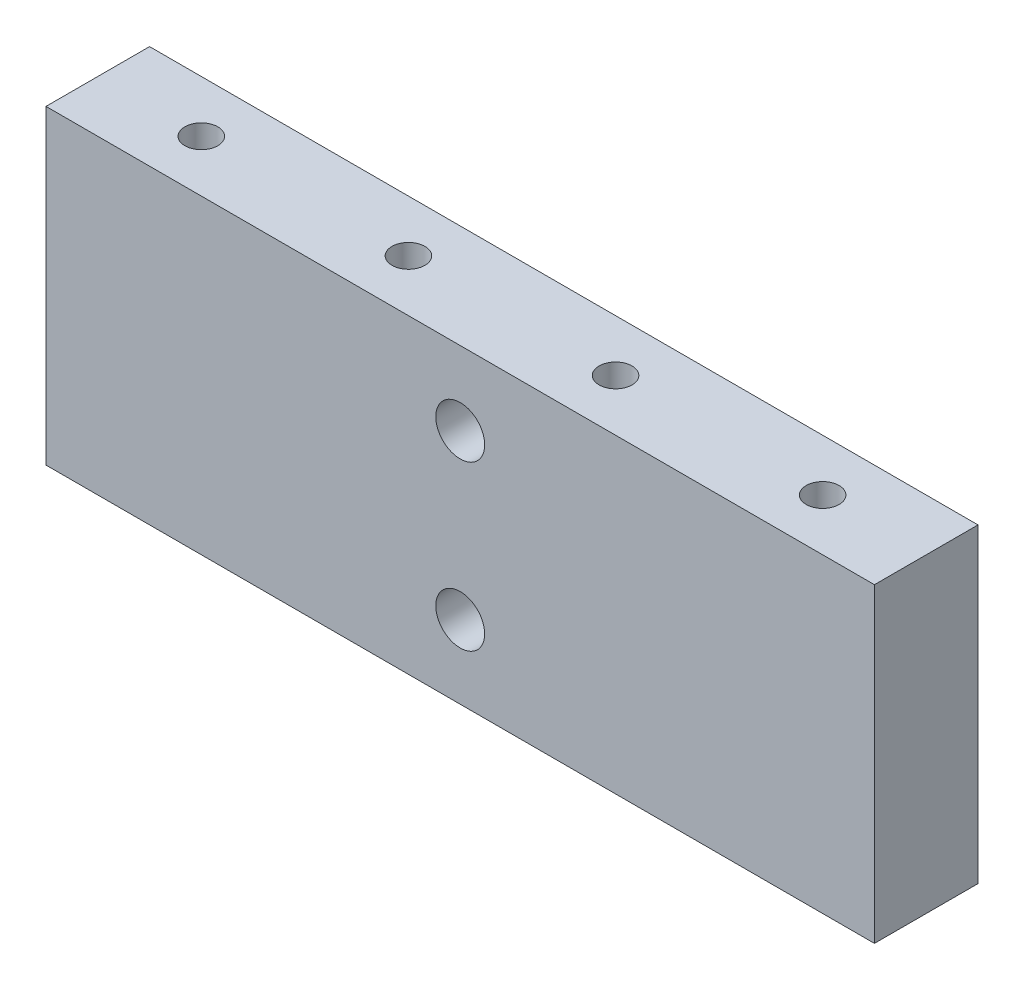
ISO-10303-21;
HEADER;
FILE_DESCRIPTION(('STEP AP214'),'2;1');
FILE_NAME('part.step','',(''),(''),'','','');
FILE_SCHEMA(('AUTOMOTIVE_DESIGN { 1 0 10303 214 1 1 1 1 }'));
ENDSEC;
DATA;
#1=APPLICATION_CONTEXT('core data for automotive mechanical design processes');
#2=APPLICATION_PROTOCOL_DEFINITION('international standard','automotive_design',2000,#1);
#3=PRODUCT_CONTEXT('',#1,'mechanical');
#4=PRODUCT('Part','Part','',(#3));
#5=PRODUCT_RELATED_PRODUCT_CATEGORY('part','',(#4));
#6=PRODUCT_DEFINITION_FORMATION('','',#4);
#7=PRODUCT_DEFINITION_CONTEXT('part definition',#1,'design');
#8=PRODUCT_DEFINITION('design','',#6,#7);
#9=PRODUCT_DEFINITION_SHAPE('','',#8);
#10=(LENGTH_UNIT() NAMED_UNIT(*) SI_UNIT(.MILLI.,.METRE.));
#11=(NAMED_UNIT(*) PLANE_ANGLE_UNIT() SI_UNIT($,.RADIAN.));
#12=(NAMED_UNIT(*) SI_UNIT($,.STERADIAN.) SOLID_ANGLE_UNIT());
#13=UNCERTAINTY_MEASURE_WITH_UNIT(LENGTH_MEASURE(1.E-05),#10,'distance_accuracy_value','');
#14=(GEOMETRIC_REPRESENTATION_CONTEXT(3) GLOBAL_UNCERTAINTY_ASSIGNED_CONTEXT((#13)) GLOBAL_UNIT_ASSIGNED_CONTEXT((#10,
#11,#12)) REPRESENTATION_CONTEXT('',''));
#15=CARTESIAN_POINT('',(0.,0.,0.));
#16=DIRECTION('',(0.,0.,1.));
#17=DIRECTION('',(1.,0.,0.));
#18=AXIS2_PLACEMENT_3D('',#15,#16,#17);
#19=CARTESIAN_POINT('',(0.,9.99998,12.7));
#20=DIRECTION('',(0.,0.,1.));
#21=DIRECTION('',(1.,0.,0.));
#22=AXIS2_PLACEMENT_3D('',#19,#20,#21);
#23=CYLINDRICAL_SURFACE('',#22,1.99999999999999);
#24=CARTESIAN_POINT('',(0.,9.99998,0.));
#25=DIRECTION('',(0.,0.,1.));
#26=DIRECTION('',(1.,0.,0.));
#27=AXIS2_PLACEMENT_3D('',#24,#25,#26);
#28=CIRCLE('',#27,2.);
#29=CARTESIAN_POINT('',(2.00000000000001,9.99998,0.));
#30=VERTEX_POINT('',#29);
#31=EDGE_CURVE('E112',#30,#30,#28,.T.);
#32=ORIENTED_EDGE('',*,*,#31,.F.);
#33=EDGE_LOOP('',(#32));
#34=FACE_BOUND('',#33,.T.);
#35=CARTESIAN_POINT('',(0.,9.99998,7.62));
#36=DIRECTION('',(0.,0.,1.));
#37=DIRECTION('',(1.,0.,0.));
#38=AXIS2_PLACEMENT_3D('',#35,#36,#37);
#39=CIRCLE('',#38,1.99999999999999);
#40=CARTESIAN_POINT('',(2.00000000000001,9.99998,7.62));
#41=VERTEX_POINT('',#40);
#42=EDGE_CURVE('E39',#41,#41,#39,.F.);
#43=ORIENTED_EDGE('',*,*,#42,.F.);
#44=EDGE_LOOP('',(#43));
#45=FACE_BOUND('',#44,.T.);
#46=ADVANCED_FACE('F35',(#34,#45),#23,.F.);
#47=CARTESIAN_POINT('',(0.,-9.99998,12.7));
#48=DIRECTION('',(0.,0.,1.));
#49=DIRECTION('',(1.,0.,0.));
#50=AXIS2_PLACEMENT_3D('',#47,#48,#49);
#51=CYLINDRICAL_SURFACE('',#50,1.99999999999999);
#52=CARTESIAN_POINT('',(0.,-9.99998,0.));
#53=DIRECTION('',(0.,0.,1.));
#54=DIRECTION('',(1.,0.,0.));
#55=AXIS2_PLACEMENT_3D('',#52,#53,#54);
#56=CIRCLE('',#55,2.);
#57=CARTESIAN_POINT('',(2.00000000000001,-9.99998,0.));
#58=VERTEX_POINT('',#57);
#59=EDGE_CURVE('E105',#58,#58,#56,.T.);
#60=ORIENTED_EDGE('',*,*,#59,.F.);
#61=EDGE_LOOP('',(#60));
#62=FACE_BOUND('',#61,.T.);
#63=CARTESIAN_POINT('',(0.,-9.99998,7.62));
#64=DIRECTION('',(0.,0.,1.));
#65=DIRECTION('',(1.,0.,0.));
#66=AXIS2_PLACEMENT_3D('',#63,#64,#65);
#67=CIRCLE('',#66,1.99999999999999);
#68=CARTESIAN_POINT('',(2.00000000000001,-9.99998,7.62));
#69=VERTEX_POINT('',#68);
#70=EDGE_CURVE('E110',#69,#69,#67,.F.);
#71=ORIENTED_EDGE('',*,*,#70,.F.);
#72=EDGE_LOOP('',(#71));
#73=FACE_BOUND('',#72,.T.);
#74=ADVANCED_FACE('F135',(#62,#73),#51,.F.);
#75=CARTESIAN_POINT('',(50.8,19.05,12.7));
#76=DIRECTION('',(-1.,0.,0.));
#77=DIRECTION('',(0.,-1.,0.));
#78=AXIS2_PLACEMENT_3D('',#75,#76,#77);
#79=PLANE('',#78);
#80=DIRECTION('',(0.,1.,0.));
#81=VECTOR('',#80,1.);
#82=CARTESIAN_POINT('',(50.8,19.05,0.));
#83=LINE('',#82,#81);
#84=CARTESIAN_POINT('',(50.8,-19.05,0.));
#85=VERTEX_POINT('',#84);
#86=CARTESIAN_POINT('',(50.8,19.05,0.));
#87=VERTEX_POINT('',#86);
#88=EDGE_CURVE('E102',#85,#87,#83,.T.);
#89=ORIENTED_EDGE('',*,*,#88,.T.);
#90=DIRECTION('',(0.,0.,-1.));
#91=VECTOR('',#90,1.);
#92=CARTESIAN_POINT('',(50.8,19.05,12.7));
#93=LINE('',#92,#91);
#94=CARTESIAN_POINT('',(50.8,19.05,12.7));
#95=VERTEX_POINT('',#94);
#96=EDGE_CURVE('E11',#95,#87,#93,.T.);
#97=ORIENTED_EDGE('',*,*,#96,.F.);
#98=DIRECTION('',(0.,1.,0.));
#99=VECTOR('',#98,1.);
#100=CARTESIAN_POINT('',(50.8,19.05,12.7));
#101=LINE('',#100,#99);
#102=CARTESIAN_POINT('',(50.8,-19.05,12.7));
#103=VERTEX_POINT('',#102);
#104=EDGE_CURVE('E89',#103,#95,#101,.T.);
#105=ORIENTED_EDGE('',*,*,#104,.F.);
#106=DIRECTION('',(0.,0.,-1.));
#107=VECTOR('',#106,1.);
#108=CARTESIAN_POINT('',(50.8,-19.05,12.7));
#109=LINE('',#108,#107);
#110=EDGE_CURVE('E98',#103,#85,#109,.T.);
#111=ORIENTED_EDGE('',*,*,#110,.T.);
#112=EDGE_LOOP('',(#89,#97,#105,#111));
#113=FACE_BOUND('',#112,.T.);
#114=ADVANCED_FACE('F37',(#113),#79,.F.);
#115=CARTESIAN_POINT('',(-50.8,19.05,12.7));
#116=DIRECTION('',(0.,-1.,0.));
#117=DIRECTION('',(0.,0.,-1.));
#118=AXIS2_PLACEMENT_3D('',#115,#116,#117);
#119=PLANE('',#118);
#120=CARTESIAN_POINT('',(38.1,19.05,6.35000000000001));
#121=DIRECTION('',(0.,1.,0.));
#122=DIRECTION('',(0.,0.,1.));
#123=AXIS2_PLACEMENT_3D('',#120,#121,#122);
#124=CIRCLE('',#123,2.01929999999999);
#125=CARTESIAN_POINT('',(38.1,19.05,8.3693));
#126=VERTEX_POINT('',#125);
#127=EDGE_CURVE('E167',#126,#126,#124,.T.);
#128=ORIENTED_EDGE('',*,*,#127,.F.);
#129=EDGE_LOOP('',(#128));
#130=FACE_BOUND('',#129,.T.);
#131=CARTESIAN_POINT('',(12.7,19.05,6.35000000000001));
#132=DIRECTION('',(0.,1.,0.));
#133=DIRECTION('',(0.,0.,1.));
#134=AXIS2_PLACEMENT_3D('',#131,#132,#133);
#135=CIRCLE('',#134,2.01929999999999);
#136=CARTESIAN_POINT('',(12.7,19.05,8.3693));
#137=VERTEX_POINT('',#136);
#138=EDGE_CURVE('E171',#137,#137,#135,.T.);
#139=ORIENTED_EDGE('',*,*,#138,.F.);
#140=EDGE_LOOP('',(#139));
#141=FACE_BOUND('',#140,.T.);
#142=CARTESIAN_POINT('',(-12.7,19.05,6.35000000000001));
#143=DIRECTION('',(0.,1.,0.));
#144=DIRECTION('',(0.,0.,1.));
#145=AXIS2_PLACEMENT_3D('',#142,#143,#144);
#146=CIRCLE('',#145,2.01929999999999);
#147=CARTESIAN_POINT('',(-12.7,19.05,8.3693));
#148=VERTEX_POINT('',#147);
#149=EDGE_CURVE('E175',#148,#148,#146,.T.);
#150=ORIENTED_EDGE('',*,*,#149,.F.);
#151=EDGE_LOOP('',(#150));
#152=FACE_BOUND('',#151,.T.);
#153=CARTESIAN_POINT('',(-38.1,19.05,6.35000000000001));
#154=DIRECTION('',(0.,1.,0.));
#155=DIRECTION('',(0.,0.,1.));
#156=AXIS2_PLACEMENT_3D('',#153,#154,#155);
#157=CIRCLE('',#156,2.01929999999999);
#158=CARTESIAN_POINT('',(-38.1,19.05,8.3693));
#159=VERTEX_POINT('',#158);
#160=EDGE_CURVE('E178',#159,#159,#157,.T.);
#161=ORIENTED_EDGE('',*,*,#160,.F.);
#162=EDGE_LOOP('',(#161));
#163=FACE_BOUND('',#162,.T.);
#164=DIRECTION('',(-1.,0.,0.));
#165=VECTOR('',#164,1.);
#166=CARTESIAN_POINT('',(-50.8,19.05,0.));
#167=LINE('',#166,#165);
#168=CARTESIAN_POINT('',(-50.8,19.05,0.));
#169=VERTEX_POINT('',#168);
#170=EDGE_CURVE('E93',#87,#169,#167,.T.);
#171=ORIENTED_EDGE('',*,*,#170,.T.);
#172=DIRECTION('',(0.,0.,-1.));
#173=VECTOR('',#172,1.);
#174=CARTESIAN_POINT('',(-50.8,19.05,12.7));
#175=LINE('',#174,#173);
#176=CARTESIAN_POINT('',(-50.8,19.05,12.7));
#177=VERTEX_POINT('',#176);
#178=EDGE_CURVE('E45',#177,#169,#175,.T.);
#179=ORIENTED_EDGE('',*,*,#178,.F.);
#180=DIRECTION('',(-1.,0.,0.));
#181=VECTOR('',#180,1.);
#182=CARTESIAN_POINT('',(-50.8,19.05,12.7));
#183=LINE('',#182,#181);
#184=EDGE_CURVE('E84',#95,#177,#183,.T.);
#185=ORIENTED_EDGE('',*,*,#184,.F.);
#186=ORIENTED_EDGE('',*,*,#96,.T.);
#187=EDGE_LOOP('',(#171,#179,#185,#186));
#188=FACE_BOUND('',#187,.T.);
#189=ADVANCED_FACE('F92',(#130,#141,#152,#163,#188),#119,.F.);
#190=CARTESIAN_POINT('',(-50.8,19.05,12.7));
#191=DIRECTION('',(1.,0.,0.));
#192=DIRECTION('',(0.,0.,-1.));
#193=AXIS2_PLACEMENT_3D('',#190,#191,#192);
#194=PLANE('',#193);
#195=DIRECTION('',(0.,-1.,0.));
#196=VECTOR('',#195,1.);
#197=CARTESIAN_POINT('',(-50.8,19.05,0.));
#198=LINE('',#197,#196);
#199=CARTESIAN_POINT('',(-50.8,-19.05,0.));
#200=VERTEX_POINT('',#199);
#201=EDGE_CURVE('E71',#169,#200,#198,.T.);
#202=ORIENTED_EDGE('',*,*,#201,.T.);
#203=DIRECTION('',(0.,0.,-1.));
#204=VECTOR('',#203,1.);
#205=CARTESIAN_POINT('',(-50.8,-19.05,12.7));
#206=LINE('',#205,#204);
#207=CARTESIAN_POINT('',(-50.8,-19.05,12.7));
#208=VERTEX_POINT('',#207);
#209=EDGE_CURVE('E94',#208,#200,#206,.T.);
#210=ORIENTED_EDGE('',*,*,#209,.F.);
#211=DIRECTION('',(0.,-1.,0.));
#212=VECTOR('',#211,1.);
#213=CARTESIAN_POINT('',(-50.8,19.05,12.7));
#214=LINE('',#213,#212);
#215=EDGE_CURVE('E87',#177,#208,#214,.T.);
#216=ORIENTED_EDGE('',*,*,#215,.F.);
#217=ORIENTED_EDGE('',*,*,#178,.T.);
#218=EDGE_LOOP('',(#202,#210,#216,#217));
#219=FACE_BOUND('',#218,.T.);
#220=ADVANCED_FACE('F96',(#219),#194,.F.);
#221=CARTESIAN_POINT('',(-50.8,-19.05,12.7));
#222=DIRECTION('',(0.,1.,0.));
#223=DIRECTION('',(0.,0.,1.));
#224=AXIS2_PLACEMENT_3D('',#221,#222,#223);
#225=PLANE('',#224);
#226=CARTESIAN_POINT('',(38.1,-19.05,6.35000000000001));
#227=DIRECTION('',(0.,1.,0.));
#228=DIRECTION('',(0.,0.,1.));
#229=AXIS2_PLACEMENT_3D('',#226,#227,#228);
#230=CIRCLE('',#229,2.01929999999999);
#231=CARTESIAN_POINT('',(38.1,-19.05,8.36930000000001));
#232=VERTEX_POINT('',#231);
#233=EDGE_CURVE('E234',#232,#232,#230,.T.);
#234=ORIENTED_EDGE('',*,*,#233,.T.);
#235=EDGE_LOOP('',(#234));
#236=FACE_BOUND('',#235,.T.);
#237=CARTESIAN_POINT('',(12.7,-19.05,6.35000000000001));
#238=DIRECTION('',(0.,1.,0.));
#239=DIRECTION('',(0.,0.,1.));
#240=AXIS2_PLACEMENT_3D('',#237,#238,#239);
#241=CIRCLE('',#240,2.01929999999999);
#242=CARTESIAN_POINT('',(12.7,-19.05,8.36930000000001));
#243=VERTEX_POINT('',#242);
#244=EDGE_CURVE('E239',#243,#243,#241,.T.);
#245=ORIENTED_EDGE('',*,*,#244,.T.);
#246=EDGE_LOOP('',(#245));
#247=FACE_BOUND('',#246,.T.);
#248=CARTESIAN_POINT('',(-12.7,-19.05,6.35000000000001));
#249=DIRECTION('',(0.,1.,0.));
#250=DIRECTION('',(0.,0.,1.));
#251=AXIS2_PLACEMENT_3D('',#248,#249,#250);
#252=CIRCLE('',#251,2.01929999999999);
#253=CARTESIAN_POINT('',(-12.7,-19.05,8.36930000000001));
#254=VERTEX_POINT('',#253);
#255=EDGE_CURVE('E181',#254,#254,#252,.T.);
#256=ORIENTED_EDGE('',*,*,#255,.T.);
#257=EDGE_LOOP('',(#256));
#258=FACE_BOUND('',#257,.T.);
#259=CARTESIAN_POINT('',(-38.1,-19.05,6.35000000000001));
#260=DIRECTION('',(0.,1.,0.));
#261=DIRECTION('',(0.,0.,1.));
#262=AXIS2_PLACEMENT_3D('',#259,#260,#261);
#263=CIRCLE('',#262,2.01929999999999);
#264=CARTESIAN_POINT('',(-38.1,-19.05,8.36930000000001));
#265=VERTEX_POINT('',#264);
#266=EDGE_CURVE('E180',#265,#265,#263,.T.);
#267=ORIENTED_EDGE('',*,*,#266,.T.);
#268=EDGE_LOOP('',(#267));
#269=FACE_BOUND('',#268,.T.);
#270=DIRECTION('',(1.,0.,0.));
#271=VECTOR('',#270,1.);
#272=CARTESIAN_POINT('',(-50.8,-19.05,0.));
#273=LINE('',#272,#271);
#274=EDGE_CURVE('E77',#200,#85,#273,.T.);
#275=ORIENTED_EDGE('',*,*,#274,.T.);
#276=ORIENTED_EDGE('',*,*,#110,.F.);
#277=DIRECTION('',(1.,0.,0.));
#278=VECTOR('',#277,1.);
#279=CARTESIAN_POINT('',(-50.8,-19.05,12.7));
#280=LINE('',#279,#278);
#281=EDGE_CURVE('E54',#208,#103,#280,.T.);
#282=ORIENTED_EDGE('',*,*,#281,.F.);
#283=ORIENTED_EDGE('',*,*,#209,.T.);
#284=EDGE_LOOP('',(#275,#276,#282,#283));
#285=FACE_BOUND('',#284,.T.);
#286=ADVANCED_FACE('F150',(#236,#247,#258,#269,#285),#225,.F.);
#287=CARTESIAN_POINT('',(0.,0.,12.7));
#288=DIRECTION('',(0.,0.,1.));
#289=DIRECTION('',(1.,0.,0.));
#290=AXIS2_PLACEMENT_3D('',#287,#288,#289);
#291=PLANE('',#290);
#292=CARTESIAN_POINT('',(0.,9.99998,12.7));
#293=DIRECTION('',(0.,0.,1.));
#294=DIRECTION('',(1.,0.,0.));
#295=AXIS2_PLACEMENT_3D('',#292,#293,#294);
#296=CIRCLE('',#295,2.9972);
#297=CARTESIAN_POINT('',(2.99720000000001,9.99998,12.7));
#298=VERTEX_POINT('',#297);
#299=EDGE_CURVE('E126',#298,#298,#296,.T.);
#300=ORIENTED_EDGE('',*,*,#299,.F.);
#301=EDGE_LOOP('',(#300));
#302=FACE_BOUND('',#301,.T.);
#303=CARTESIAN_POINT('',(0.,-10.0794861288054,12.7));
#304=DIRECTION('',(0.,0.,1.));
#305=DIRECTION('',(1.,0.,0.));
#306=AXIS2_PLACEMENT_3D('',#303,#304,#305);
#307=CIRCLE('',#306,2.9972);
#308=CARTESIAN_POINT('',(2.9972,-10.0794861288054,12.7));
#309=VERTEX_POINT('',#308);
#310=EDGE_CURVE('E119',#309,#309,#307,.T.);
#311=ORIENTED_EDGE('',*,*,#310,.F.);
#312=EDGE_LOOP('',(#311));
#313=FACE_BOUND('',#312,.T.);
#314=ORIENTED_EDGE('',*,*,#104,.T.);
#315=ORIENTED_EDGE('',*,*,#184,.T.);
#316=ORIENTED_EDGE('',*,*,#215,.T.);
#317=ORIENTED_EDGE('',*,*,#281,.T.);
#318=EDGE_LOOP('',(#314,#315,#316,#317));
#319=FACE_BOUND('',#318,.T.);
#320=ADVANCED_FACE('F85',(#302,#313,#319),#291,.T.);
#321=CARTESIAN_POINT('',(0.,0.,0.));
#322=DIRECTION('',(0.,0.,1.));
#323=DIRECTION('',(1.,0.,0.));
#324=AXIS2_PLACEMENT_3D('',#321,#322,#323);
#325=PLANE('',#324);
#326=ORIENTED_EDGE('',*,*,#31,.T.);
#327=EDGE_LOOP('',(#326));
#328=FACE_BOUND('',#327,.T.);
#329=ORIENTED_EDGE('',*,*,#59,.T.);
#330=EDGE_LOOP('',(#329));
#331=FACE_BOUND('',#330,.T.);
#332=ORIENTED_EDGE('',*,*,#88,.F.);
#333=ORIENTED_EDGE('',*,*,#274,.F.);
#334=ORIENTED_EDGE('',*,*,#201,.F.);
#335=ORIENTED_EDGE('',*,*,#170,.F.);
#336=EDGE_LOOP('',(#332,#333,#334,#335));
#337=FACE_BOUND('',#336,.T.);
#338=ADVANCED_FACE('F132',(#328,#331,#337),#325,.F.);
#339=CARTESIAN_POINT('',(0.,-10.0794861288054,7.62));
#340=DIRECTION('',(0.,0.,1.));
#341=DIRECTION('',(1.,0.,0.));
#342=AXIS2_PLACEMENT_3D('',#339,#340,#341);
#343=PLANE('',#342);
#344=CARTESIAN_POINT('',(0.,-10.0794861288054,7.62));
#345=DIRECTION('',(0.,0.,1.));
#346=DIRECTION('',(1.,0.,0.));
#347=AXIS2_PLACEMENT_3D('',#344,#345,#346);
#348=CIRCLE('',#347,2.9972);
#349=CARTESIAN_POINT('',(2.9972,-10.0794861288054,7.62));
#350=VERTEX_POINT('',#349);
#351=EDGE_CURVE('E113',#350,#350,#348,.T.);
#352=ORIENTED_EDGE('',*,*,#351,.T.);
#353=EDGE_LOOP('',(#352));
#354=FACE_BOUND('',#353,.T.);
#355=ORIENTED_EDGE('',*,*,#70,.T.);
#356=EDGE_LOOP('',(#355));
#357=FACE_BOUND('',#356,.T.);
#358=ADVANCED_FACE('F154',(#354,#357),#343,.T.);
#359=CARTESIAN_POINT('',(0.,-10.0794861288054,7.62));
#360=DIRECTION('',(0.,0.,1.));
#361=DIRECTION('',(1.,0.,0.));
#362=AXIS2_PLACEMENT_3D('',#359,#360,#361);
#363=CYLINDRICAL_SURFACE('',#362,2.9972);
#364=ORIENTED_EDGE('',*,*,#351,.F.);
#365=EDGE_LOOP('',(#364));
#366=FACE_BOUND('',#365,.T.);
#367=ORIENTED_EDGE('',*,*,#310,.T.);
#368=EDGE_LOOP('',(#367));
#369=FACE_BOUND('',#368,.T.);
#370=ADVANCED_FACE('F200',(#366,#369),#363,.F.);
#371=CARTESIAN_POINT('',(0.,9.99998,7.62));
#372=DIRECTION('',(0.,0.,1.));
#373=DIRECTION('',(1.,0.,0.));
#374=AXIS2_PLACEMENT_3D('',#371,#372,#373);
#375=PLANE('',#374);
#376=CARTESIAN_POINT('',(0.,9.99998,7.62));
#377=DIRECTION('',(0.,0.,1.));
#378=DIRECTION('',(1.,0.,0.));
#379=AXIS2_PLACEMENT_3D('',#376,#377,#378);
#380=CIRCLE('',#379,2.9972);
#381=CARTESIAN_POINT('',(2.99720000000001,9.99998,7.62));
#382=VERTEX_POINT('',#381);
#383=EDGE_CURVE('E188',#382,#382,#380,.T.);
#384=ORIENTED_EDGE('',*,*,#383,.T.);
#385=EDGE_LOOP('',(#384));
#386=FACE_BOUND('',#385,.T.);
#387=ORIENTED_EDGE('',*,*,#42,.T.);
#388=EDGE_LOOP('',(#387));
#389=FACE_BOUND('',#388,.T.);
#390=ADVANCED_FACE('F202',(#386,#389),#375,.T.);
#391=CARTESIAN_POINT('',(0.,9.99998,7.62));
#392=DIRECTION('',(0.,0.,1.));
#393=DIRECTION('',(1.,0.,0.));
#394=AXIS2_PLACEMENT_3D('',#391,#392,#393);
#395=CYLINDRICAL_SURFACE('',#394,2.9972);
#396=ORIENTED_EDGE('',*,*,#383,.F.);
#397=EDGE_LOOP('',(#396));
#398=FACE_BOUND('',#397,.T.);
#399=ORIENTED_EDGE('',*,*,#299,.T.);
#400=EDGE_LOOP('',(#399));
#401=FACE_BOUND('',#400,.T.);
#402=ADVANCED_FACE('F196',(#398,#401),#395,.F.);
#403=CARTESIAN_POINT('',(-38.1,19.05,6.35000000000001));
#404=DIRECTION('',(0.,1.,0.));
#405=DIRECTION('',(0.,0.,1.));
#406=AXIS2_PLACEMENT_3D('',#403,#404,#405);
#407=CYLINDRICAL_SURFACE('',#406,2.01929999999999);
#408=ORIENTED_EDGE('',*,*,#266,.F.);
#409=EDGE_LOOP('',(#408));
#410=FACE_BOUND('',#409,.T.);
#411=ORIENTED_EDGE('',*,*,#160,.T.);
#412=EDGE_LOOP('',(#411));
#413=FACE_BOUND('',#412,.T.);
#414=ADVANCED_FACE('F212',(#410,#413),#407,.F.);
#415=CARTESIAN_POINT('',(-12.7,19.05,6.35000000000001));
#416=DIRECTION('',(0.,1.,0.));
#417=DIRECTION('',(0.,0.,1.));
#418=AXIS2_PLACEMENT_3D('',#415,#416,#417);
#419=CYLINDRICAL_SURFACE('',#418,2.01929999999999);
#420=ORIENTED_EDGE('',*,*,#255,.F.);
#421=EDGE_LOOP('',(#420));
#422=FACE_BOUND('',#421,.T.);
#423=ORIENTED_EDGE('',*,*,#149,.T.);
#424=EDGE_LOOP('',(#423));
#425=FACE_BOUND('',#424,.T.);
#426=ADVANCED_FACE('F217',(#422,#425),#419,.F.);
#427=CARTESIAN_POINT('',(12.7,19.05,6.35000000000001));
#428=DIRECTION('',(0.,1.,0.));
#429=DIRECTION('',(0.,0.,1.));
#430=AXIS2_PLACEMENT_3D('',#427,#428,#429);
#431=CYLINDRICAL_SURFACE('',#430,2.01929999999999);
#432=ORIENTED_EDGE('',*,*,#244,.F.);
#433=EDGE_LOOP('',(#432));
#434=FACE_BOUND('',#433,.T.);
#435=ORIENTED_EDGE('',*,*,#138,.T.);
#436=EDGE_LOOP('',(#435));
#437=FACE_BOUND('',#436,.T.);
#438=ADVANCED_FACE('F221',(#434,#437),#431,.F.);
#439=CARTESIAN_POINT('',(38.1,19.05,6.35000000000001));
#440=DIRECTION('',(0.,1.,0.));
#441=DIRECTION('',(0.,0.,1.));
#442=AXIS2_PLACEMENT_3D('',#439,#440,#441);
#443=CYLINDRICAL_SURFACE('',#442,2.01929999999999);
#444=ORIENTED_EDGE('',*,*,#233,.F.);
#445=EDGE_LOOP('',(#444));
#446=FACE_BOUND('',#445,.T.);
#447=ORIENTED_EDGE('',*,*,#127,.T.);
#448=EDGE_LOOP('',(#447));
#449=FACE_BOUND('',#448,.T.);
#450=ADVANCED_FACE('F225',(#446,#449),#443,.F.);
#451=CLOSED_SHELL('',(#46,#74,#114,#189,#220,#286,#320,#338,#358,#370,#390,#402,#414,#426,#438,#450));
#452=MANIFOLD_SOLID_BREP('B2',#451);
#453=ADVANCED_BREP_SHAPE_REPRESENTATION('',(#18,#452),#14);
#454=SHAPE_DEFINITION_REPRESENTATION(#9,#453);
ENDSEC;
END-ISO-10303-21;
